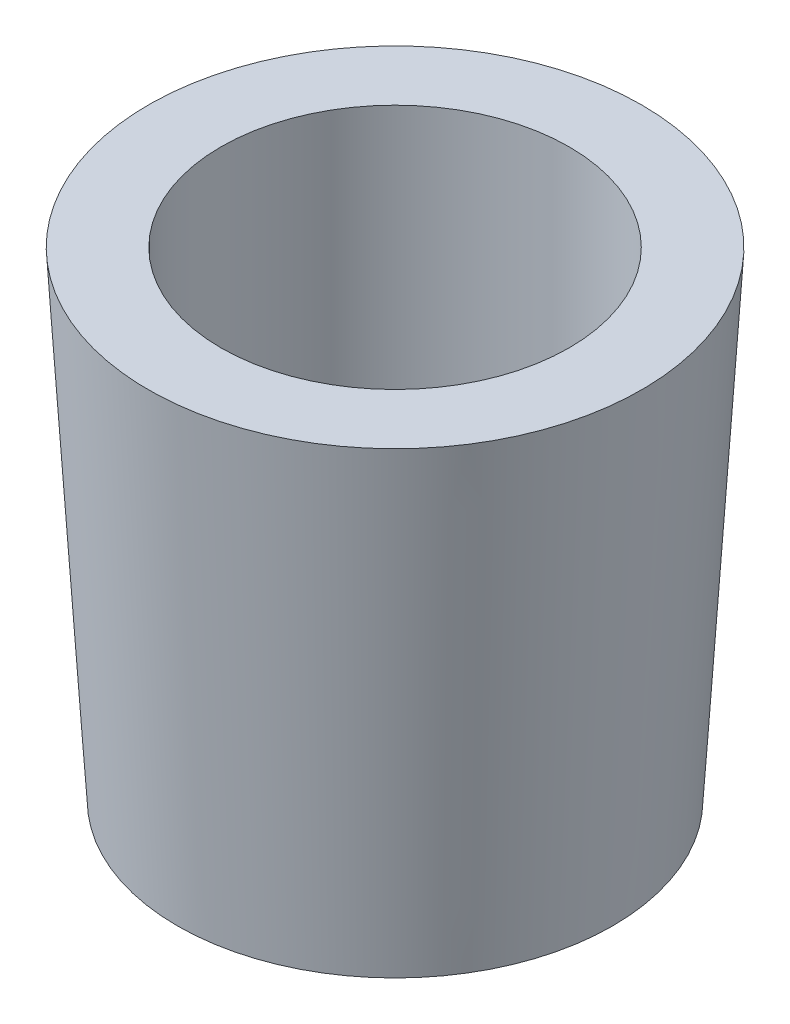
ISO-10303-21;
HEADER;
FILE_DESCRIPTION(('STEP AP214'),'2;1');
FILE_NAME('part.step','',(''),(''),'','','');
FILE_SCHEMA(('AUTOMOTIVE_DESIGN { 1 0 10303 214 1 1 1 1 }'));
ENDSEC;
DATA;
#1=APPLICATION_CONTEXT('core data for automotive mechanical design processes');
#2=APPLICATION_PROTOCOL_DEFINITION('international standard','automotive_design',2000,#1);
#3=PRODUCT_CONTEXT('',#1,'mechanical');
#4=PRODUCT('Part','Part','',(#3));
#5=PRODUCT_RELATED_PRODUCT_CATEGORY('part','',(#4));
#6=PRODUCT_DEFINITION_FORMATION('','',#4);
#7=PRODUCT_DEFINITION_CONTEXT('part definition',#1,'design');
#8=PRODUCT_DEFINITION('design','',#6,#7);
#9=PRODUCT_DEFINITION_SHAPE('','',#8);
#10=(LENGTH_UNIT() NAMED_UNIT(*) SI_UNIT(.MILLI.,.METRE.));
#11=(NAMED_UNIT(*) PLANE_ANGLE_UNIT() SI_UNIT($,.RADIAN.));
#12=(NAMED_UNIT(*) SI_UNIT($,.STERADIAN.) SOLID_ANGLE_UNIT());
#13=UNCERTAINTY_MEASURE_WITH_UNIT(LENGTH_MEASURE(1.E-05),#10,'distance_accuracy_value','');
#14=(GEOMETRIC_REPRESENTATION_CONTEXT(3) GLOBAL_UNCERTAINTY_ASSIGNED_CONTEXT((#13)) GLOBAL_UNIT_ASSIGNED_CONTEXT((#10,
#11,#12)) REPRESENTATION_CONTEXT('',''));
#15=CARTESIAN_POINT('',(0.,0.,0.));
#16=DIRECTION('',(0.,0.,1.));
#17=DIRECTION('',(1.,0.,0.));
#18=AXIS2_PLACEMENT_3D('',#15,#16,#17);
#19=CARTESIAN_POINT('',(0.,0.,0.));
#20=DIRECTION('',(0.,-1.,0.));
#21=DIRECTION('',(0.,0.,-1.));
#22=AXIS2_PLACEMENT_3D('',#19,#20,#21);
#23=PLANE('',#22);
#24=CARTESIAN_POINT('',(0.,0.,0.));
#25=DIRECTION('',(0.,-1.,0.));
#26=DIRECTION('',(0.,0.,-1.));
#27=AXIS2_PLACEMENT_3D('',#24,#25,#26);
#28=CIRCLE('',#27,5.);
#29=CARTESIAN_POINT('',(0.,0.,-5.));
#30=VERTEX_POINT('',#29);
#31=EDGE_CURVE('E51',#30,#30,#28,.T.);
#32=ORIENTED_EDGE('',*,*,#31,.F.);
#33=EDGE_LOOP('',(#32));
#34=FACE_BOUND('',#33,.T.);
#35=CARTESIAN_POINT('',(0.,0.,0.));
#36=DIRECTION('',(0.,-1.,0.));
#37=DIRECTION('',(0.,0.,-1.));
#38=AXIS2_PLACEMENT_3D('',#35,#36,#37);
#39=CIRCLE('',#38,7.5);
#40=CARTESIAN_POINT('',(0.,0.,-7.5));
#41=VERTEX_POINT('',#40);
#42=EDGE_CURVE('E10',#41,#41,#39,.T.);
#43=ORIENTED_EDGE('',*,*,#42,.T.);
#44=EDGE_LOOP('',(#43));
#45=FACE_BOUND('',#44,.T.);
#46=ADVANCED_FACE('F31',(#34,#45),#23,.T.);
#47=CARTESIAN_POINT('',(0.,0.,0.));
#48=DIRECTION('',(0.,1.,0.));
#49=DIRECTION('',(0.,0.,1.));
#50=AXIS2_PLACEMENT_3D('',#47,#48,#49);
#51=CONICAL_SURFACE('',#50,7.5,0.0605320197821072);
#52=CARTESIAN_POINT('',(0.,16.5,0.));
#53=DIRECTION('',(0.,-1.,0.));
#54=DIRECTION('',(0.,0.,-1.));
#55=AXIS2_PLACEMENT_3D('',#52,#53,#54);
#56=CIRCLE('',#55,8.5);
#57=CARTESIAN_POINT('',(0.,16.5,-8.5));
#58=VERTEX_POINT('',#57);
#59=EDGE_CURVE('E37',#58,#58,#56,.T.);
#60=ORIENTED_EDGE('',*,*,#59,.T.);
#61=EDGE_LOOP('',(#60));
#62=FACE_BOUND('',#61,.T.);
#63=ORIENTED_EDGE('',*,*,#42,.F.);
#64=EDGE_LOOP('',(#63));
#65=FACE_BOUND('',#64,.T.);
#66=ADVANCED_FACE('F67',(#62,#65),#51,.T.);
#67=CARTESIAN_POINT('',(0.,16.5,0.));
#68=DIRECTION('',(0.,1.,0.));
#69=DIRECTION('',(0.,0.,1.));
#70=AXIS2_PLACEMENT_3D('',#67,#68,#69);
#71=PLANE('',#70);
#72=CARTESIAN_POINT('',(0.,16.5,0.));
#73=DIRECTION('',(0.,1.,0.));
#74=DIRECTION('',(0.,0.,1.));
#75=AXIS2_PLACEMENT_3D('',#72,#73,#74);
#76=CIRCLE('',#75,6.);
#77=CARTESIAN_POINT('',(0.,16.5,6.));
#78=VERTEX_POINT('',#77);
#79=EDGE_CURVE('E45',#78,#78,#76,.T.);
#80=ORIENTED_EDGE('',*,*,#79,.F.);
#81=EDGE_LOOP('',(#80));
#82=FACE_BOUND('',#81,.T.);
#83=ORIENTED_EDGE('',*,*,#59,.F.);
#84=EDGE_LOOP('',(#83));
#85=FACE_BOUND('',#84,.T.);
#86=ADVANCED_FACE('F71',(#82,#85),#71,.T.);
#87=CARTESIAN_POINT('',(0.,6.5,0.));
#88=DIRECTION('',(0.,1.,0.));
#89=DIRECTION('',(0.,0.,1.));
#90=AXIS2_PLACEMENT_3D('',#87,#88,#89);
#91=CYLINDRICAL_SURFACE('',#90,6.);
#92=CARTESIAN_POINT('',(0.,6.5,0.));
#93=DIRECTION('',(0.,1.,0.));
#94=DIRECTION('',(0.,0.,1.));
#95=AXIS2_PLACEMENT_3D('',#92,#93,#94);
#96=CIRCLE('',#95,6.);
#97=CARTESIAN_POINT('',(0.,6.5,6.));
#98=VERTEX_POINT('',#97);
#99=EDGE_CURVE('E41',#98,#98,#96,.T.);
#100=ORIENTED_EDGE('',*,*,#99,.F.);
#101=EDGE_LOOP('',(#100));
#102=FACE_BOUND('',#101,.T.);
#103=ORIENTED_EDGE('',*,*,#79,.T.);
#104=EDGE_LOOP('',(#103));
#105=FACE_BOUND('',#104,.T.);
#106=ADVANCED_FACE('F75',(#102,#105),#91,.F.);
#107=CARTESIAN_POINT('',(0.,6.5,0.));
#108=DIRECTION('',(0.,1.,0.));
#109=DIRECTION('',(0.,0.,1.));
#110=AXIS2_PLACEMENT_3D('',#107,#108,#109);
#111=PLANE('',#110);
#112=ORIENTED_EDGE('',*,*,#99,.T.);
#113=EDGE_LOOP('',(#112));
#114=FACE_BOUND('',#113,.T.);
#115=ADVANCED_FACE('F62',(#114),#111,.T.);
#116=CARTESIAN_POINT('',(0.,4.,0.));
#117=DIRECTION('',(0.,-1.,0.));
#118=DIRECTION('',(0.,0.,-1.));
#119=AXIS2_PLACEMENT_3D('',#116,#117,#118);
#120=CYLINDRICAL_SURFACE('',#119,5.);
#121=CARTESIAN_POINT('',(0.,4.,0.));
#122=DIRECTION('',(0.,-1.,0.));
#123=DIRECTION('',(0.,0.,-1.));
#124=AXIS2_PLACEMENT_3D('',#121,#122,#123);
#125=CIRCLE('',#124,5.);
#126=CARTESIAN_POINT('',(0.,4.,-5.));
#127=VERTEX_POINT('',#126);
#128=EDGE_CURVE('E49',#127,#127,#125,.T.);
#129=ORIENTED_EDGE('',*,*,#128,.F.);
#130=EDGE_LOOP('',(#129));
#131=FACE_BOUND('',#130,.T.);
#132=ORIENTED_EDGE('',*,*,#31,.T.);
#133=EDGE_LOOP('',(#132));
#134=FACE_BOUND('',#133,.T.);
#135=ADVANCED_FACE('F59',(#131,#134),#120,.F.);
#136=CARTESIAN_POINT('',(0.,4.,0.));
#137=DIRECTION('',(0.,-1.,0.));
#138=DIRECTION('',(0.,0.,-1.));
#139=AXIS2_PLACEMENT_3D('',#136,#137,#138);
#140=PLANE('',#139);
#141=ORIENTED_EDGE('',*,*,#128,.T.);
#142=EDGE_LOOP('',(#141));
#143=FACE_BOUND('',#142,.T.);
#144=ADVANCED_FACE('F57',(#143),#140,.T.);
#145=CLOSED_SHELL('',(#46,#66,#86,#106,#115,#135,#144));
#146=MANIFOLD_SOLID_BREP('B2',#145);
#147=ADVANCED_BREP_SHAPE_REPRESENTATION('',(#18,#146),#14);
#148=SHAPE_DEFINITION_REPRESENTATION(#9,#147);
ENDSEC;
END-ISO-10303-21;
